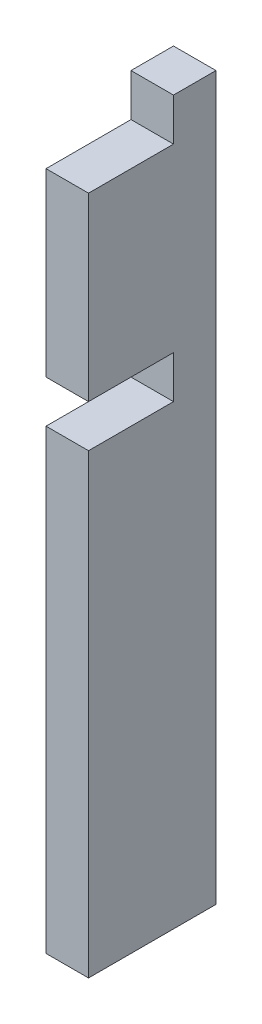
ISO-10303-21;
HEADER;
FILE_DESCRIPTION(('STEP AP214'),'2;1');
FILE_NAME('part.step','',(''),(''),'','','');
FILE_SCHEMA(('AUTOMOTIVE_DESIGN { 1 0 10303 214 1 1 1 1 }'));
ENDSEC;
DATA;
#1=APPLICATION_CONTEXT('core data for automotive mechanical design processes');
#2=APPLICATION_PROTOCOL_DEFINITION('international standard','automotive_design',2000,#1);
#3=PRODUCT_CONTEXT('',#1,'mechanical');
#4=PRODUCT('Part','Part','',(#3));
#5=PRODUCT_RELATED_PRODUCT_CATEGORY('part','',(#4));
#6=PRODUCT_DEFINITION_FORMATION('','',#4);
#7=PRODUCT_DEFINITION_CONTEXT('part definition',#1,'design');
#8=PRODUCT_DEFINITION('design','',#6,#7);
#9=PRODUCT_DEFINITION_SHAPE('','',#8);
#10=(LENGTH_UNIT() NAMED_UNIT(*) SI_UNIT(.MILLI.,.METRE.));
#11=(NAMED_UNIT(*) PLANE_ANGLE_UNIT() SI_UNIT($,.RADIAN.));
#12=(NAMED_UNIT(*) SI_UNIT($,.STERADIAN.) SOLID_ANGLE_UNIT());
#13=UNCERTAINTY_MEASURE_WITH_UNIT(LENGTH_MEASURE(1.E-05),#10,'distance_accuracy_value','');
#14=(GEOMETRIC_REPRESENTATION_CONTEXT(3) GLOBAL_UNCERTAINTY_ASSIGNED_CONTEXT((#13)) GLOBAL_UNIT_ASSIGNED_CONTEXT((#10,
#11,#12)) REPRESENTATION_CONTEXT('',''));
#15=CARTESIAN_POINT('',(0.,0.,0.));
#16=DIRECTION('',(0.,0.,1.));
#17=DIRECTION('',(1.,0.,0.));
#18=AXIS2_PLACEMENT_3D('',#15,#16,#17);
#19=CARTESIAN_POINT('',(3.175,53.975,9.52500000000001));
#20=DIRECTION('',(0.,0.,-1.));
#21=DIRECTION('',(0.,1.,0.));
#22=AXIS2_PLACEMENT_3D('',#19,#20,#21);
#23=PLANE('',#22);
#24=DIRECTION('',(0.,-1.,0.));
#25=VECTOR('',#24,1.);
#26=CARTESIAN_POINT('',(-3.175,53.975,9.52500000000001));
#27=LINE('',#26,#25);
#28=CARTESIAN_POINT('',(-3.175,47.625,9.52500000000001));
#29=VERTEX_POINT('',#28);
#30=CARTESIAN_POINT('',(-3.175,20.6375,9.52500000000001));
#31=VERTEX_POINT('',#30);
#32=EDGE_CURVE('E131',#29,#31,#27,.T.);
#33=ORIENTED_EDGE('',*,*,#32,.T.);
#34=DIRECTION('',(1.,0.,0.));
#35=VECTOR('',#34,1.);
#36=CARTESIAN_POINT('',(-3.175,20.6375,9.52500000000001));
#37=LINE('',#36,#35);
#38=CARTESIAN_POINT('',(3.175,20.6375,9.52500000000001));
#39=VERTEX_POINT('',#38);
#40=EDGE_CURVE('E187',#31,#39,#37,.T.);
#41=ORIENTED_EDGE('',*,*,#40,.T.);
#42=DIRECTION('',(0.,-1.,0.));
#43=VECTOR('',#42,1.);
#44=CARTESIAN_POINT('',(3.175,53.975,9.52500000000001));
#45=LINE('',#44,#43);
#46=CARTESIAN_POINT('',(3.175,47.625,9.52500000000001));
#47=VERTEX_POINT('',#46);
#48=EDGE_CURVE('E152',#47,#39,#45,.T.);
#49=ORIENTED_EDGE('',*,*,#48,.F.);
#50=DIRECTION('',(1.,0.,0.));
#51=VECTOR('',#50,1.);
#52=CARTESIAN_POINT('',(-3.175,47.625,9.52500000000001));
#53=LINE('',#52,#51);
#54=EDGE_CURVE('E166',#29,#47,#53,.T.);
#55=ORIENTED_EDGE('',*,*,#54,.F.);
#56=EDGE_LOOP('',(#33,#41,#49,#55));
#57=FACE_BOUND('',#56,.T.);
#58=ADVANCED_FACE('F31',(#57),#23,.F.);
#59=CARTESIAN_POINT('',(3.175,53.975,-9.52499999999999));
#60=DIRECTION('',(0.,0.,1.));
#61=DIRECTION('',(0.,-1.,0.));
#62=AXIS2_PLACEMENT_3D('',#59,#60,#61);
#63=PLANE('',#62);
#64=DIRECTION('',(0.,1.,0.));
#65=VECTOR('',#64,1.);
#66=CARTESIAN_POINT('',(-3.175,53.975,-9.52499999999999));
#67=LINE('',#66,#65);
#68=CARTESIAN_POINT('',(-3.175,-53.975,-9.52500000000001));
#69=VERTEX_POINT('',#68);
#70=CARTESIAN_POINT('',(-3.175,53.975,-9.52499999999999));
#71=VERTEX_POINT('',#70);
#72=EDGE_CURVE('E136',#69,#71,#67,.T.);
#73=ORIENTED_EDGE('',*,*,#72,.T.);
#74=DIRECTION('',(-1.,0.,0.));
#75=VECTOR('',#74,1.);
#76=CARTESIAN_POINT('',(3.175,53.975,-9.52499999999999));
#77=LINE('',#76,#75);
#78=CARTESIAN_POINT('',(3.175,53.975,-9.52499999999999));
#79=VERTEX_POINT('',#78);
#80=EDGE_CURVE('E11',#79,#71,#77,.T.);
#81=ORIENTED_EDGE('',*,*,#80,.F.);
#82=DIRECTION('',(0.,1.,0.));
#83=VECTOR('',#82,1.);
#84=CARTESIAN_POINT('',(3.175,53.975,-9.52499999999999));
#85=LINE('',#84,#83);
#86=CARTESIAN_POINT('',(3.175,-53.975,-9.52500000000001));
#87=VERTEX_POINT('',#86);
#88=EDGE_CURVE('E141',#87,#79,#85,.T.);
#89=ORIENTED_EDGE('',*,*,#88,.F.);
#90=DIRECTION('',(-1.,0.,0.));
#91=VECTOR('',#90,1.);
#92=CARTESIAN_POINT('',(3.175,-53.975,-9.52500000000001));
#93=LINE('',#92,#91);
#94=EDGE_CURVE('E142',#87,#69,#93,.T.);
#95=ORIENTED_EDGE('',*,*,#94,.T.);
#96=EDGE_LOOP('',(#73,#81,#89,#95));
#97=FACE_BOUND('',#96,.T.);
#98=ADVANCED_FACE('F33',(#97),#63,.F.);
#99=CARTESIAN_POINT('',(3.175,53.975,9.52500000000001));
#100=DIRECTION('',(0.,-1.,0.));
#101=DIRECTION('',(0.,0.,-1.));
#102=AXIS2_PLACEMENT_3D('',#99,#100,#101);
#103=PLANE('',#102);
#104=DIRECTION('',(0.,0.,1.));
#105=VECTOR('',#104,1.);
#106=CARTESIAN_POINT('',(-3.175,53.975,9.52500000000001));
#107=LINE('',#106,#105);
#108=CARTESIAN_POINT('',(-3.175,53.975,-3.17499999999999));
#109=VERTEX_POINT('',#108);
#110=EDGE_CURVE('E132',#71,#109,#107,.T.);
#111=ORIENTED_EDGE('',*,*,#110,.T.);
#112=DIRECTION('',(1.,0.,0.));
#113=VECTOR('',#112,1.);
#114=CARTESIAN_POINT('',(-3.175,53.975,-3.17499999999999));
#115=LINE('',#114,#113);
#116=CARTESIAN_POINT('',(3.175,53.975,-3.17499999999999));
#117=VERTEX_POINT('',#116);
#118=EDGE_CURVE('E158',#109,#117,#115,.T.);
#119=ORIENTED_EDGE('',*,*,#118,.T.);
#120=DIRECTION('',(0.,0.,1.));
#121=VECTOR('',#120,1.);
#122=CARTESIAN_POINT('',(3.175,53.975,9.52500000000001));
#123=LINE('',#122,#121);
#124=EDGE_CURVE('E173',#79,#117,#123,.T.);
#125=ORIENTED_EDGE('',*,*,#124,.F.);
#126=ORIENTED_EDGE('',*,*,#80,.T.);
#127=EDGE_LOOP('',(#111,#119,#125,#126));
#128=FACE_BOUND('',#127,.T.);
#129=ADVANCED_FACE('F225',(#128),#103,.F.);
#130=CARTESIAN_POINT('',(3.175,14.2875,9.525));
#131=VERTEX_POINT('',#130);
#132=CARTESIAN_POINT('',(3.175,-53.975,9.52499999999999));
#133=VERTEX_POINT('',#132);
#134=EDGE_CURVE('E124',#131,#133,#45,.T.);
#135=ORIENTED_EDGE('',*,*,#134,.F.);
#136=DIRECTION('',(1.,0.,0.));
#137=VECTOR('',#136,1.);
#138=CARTESIAN_POINT('',(-3.175,14.2875,9.525));
#139=LINE('',#138,#137);
#140=CARTESIAN_POINT('',(-3.175,14.2875,9.525));
#141=VERTEX_POINT('',#140);
#142=EDGE_CURVE('E111',#141,#131,#139,.T.);
#143=ORIENTED_EDGE('',*,*,#142,.F.);
#144=CARTESIAN_POINT('',(-3.175,-53.975,9.52499999999999));
#145=VERTEX_POINT('',#144);
#146=EDGE_CURVE('E122',#141,#145,#27,.T.);
#147=ORIENTED_EDGE('',*,*,#146,.T.);
#148=DIRECTION('',(-1.,0.,0.));
#149=VECTOR('',#148,1.);
#150=CARTESIAN_POINT('',(3.175,-53.975,9.52499999999999));
#151=LINE('',#150,#149);
#152=EDGE_CURVE('E39',#133,#145,#151,.T.);
#153=ORIENTED_EDGE('',*,*,#152,.F.);
#154=EDGE_LOOP('',(#135,#143,#147,#153));
#155=FACE_BOUND('',#154,.T.);
#156=ADVANCED_FACE('F120',(#155),#23,.F.);
#157=CARTESIAN_POINT('',(3.175,-53.975,9.52499999999999));
#158=DIRECTION('',(0.,1.,0.));
#159=DIRECTION('',(0.,0.,1.));
#160=AXIS2_PLACEMENT_3D('',#157,#158,#159);
#161=PLANE('',#160);
#162=DIRECTION('',(0.,0.,-1.));
#163=VECTOR('',#162,1.);
#164=CARTESIAN_POINT('',(-3.175,-53.975,9.52499999999999));
#165=LINE('',#164,#163);
#166=EDGE_CURVE('E130',#145,#69,#165,.T.);
#167=ORIENTED_EDGE('',*,*,#166,.T.);
#168=ORIENTED_EDGE('',*,*,#94,.F.);
#169=DIRECTION('',(0.,0.,-1.));
#170=VECTOR('',#169,1.);
#171=CARTESIAN_POINT('',(3.175,-53.975,9.52499999999999));
#172=LINE('',#171,#170);
#173=EDGE_CURVE('E144',#133,#87,#172,.T.);
#174=ORIENTED_EDGE('',*,*,#173,.F.);
#175=ORIENTED_EDGE('',*,*,#152,.T.);
#176=EDGE_LOOP('',(#167,#168,#174,#175));
#177=FACE_BOUND('',#176,.T.);
#178=ADVANCED_FACE('F147',(#177),#161,.F.);
#179=CARTESIAN_POINT('',(3.175,-53.975,-9.525));
#180=DIRECTION('',(1.,0.,0.));
#181=DIRECTION('',(0.,0.,-1.));
#182=AXIS2_PLACEMENT_3D('',#179,#180,#181);
#183=PLANE('',#182);
#184=DIRECTION('',(0.,0.,1.));
#185=VECTOR('',#184,1.);
#186=CARTESIAN_POINT('',(3.175,20.6375,9.52500000000001));
#187=LINE('',#186,#185);
#188=CARTESIAN_POINT('',(3.175,20.6375,-3.175));
#189=VERTEX_POINT('',#188);
#190=EDGE_CURVE('E116',#189,#39,#187,.T.);
#191=ORIENTED_EDGE('',*,*,#190,.F.);
#192=DIRECTION('',(0.,1.,0.));
#193=VECTOR('',#192,1.);
#194=CARTESIAN_POINT('',(3.175,20.6375,-3.175));
#195=LINE('',#194,#193);
#196=CARTESIAN_POINT('',(3.175,14.2875,-3.175));
#197=VERTEX_POINT('',#196);
#198=EDGE_CURVE('E180',#197,#189,#195,.T.);
#199=ORIENTED_EDGE('',*,*,#198,.F.);
#200=DIRECTION('',(0.,0.,-1.));
#201=VECTOR('',#200,1.);
#202=CARTESIAN_POINT('',(3.175,14.2875,9.525));
#203=LINE('',#202,#201);
#204=EDGE_CURVE('E178',#131,#197,#203,.T.);
#205=ORIENTED_EDGE('',*,*,#204,.F.);
#206=ORIENTED_EDGE('',*,*,#134,.T.);
#207=ORIENTED_EDGE('',*,*,#173,.T.);
#208=ORIENTED_EDGE('',*,*,#88,.T.);
#209=ORIENTED_EDGE('',*,*,#124,.T.);
#210=DIRECTION('',(0.,1.,0.));
#211=VECTOR('',#210,1.);
#212=CARTESIAN_POINT('',(3.175,53.975,-3.17499999999999));
#213=LINE('',#212,#211);
#214=CARTESIAN_POINT('',(3.175,47.625,-3.17499999999999));
#215=VERTEX_POINT('',#214);
#216=EDGE_CURVE('E169',#215,#117,#213,.T.);
#217=ORIENTED_EDGE('',*,*,#216,.F.);
#218=DIRECTION('',(0.,0.,-1.));
#219=VECTOR('',#218,1.);
#220=CARTESIAN_POINT('',(3.175,47.625,9.52500000000001));
#221=LINE('',#220,#219);
#222=EDGE_CURVE('E190',#47,#215,#221,.T.);
#223=ORIENTED_EDGE('',*,*,#222,.F.);
#224=ORIENTED_EDGE('',*,*,#48,.T.);
#225=EDGE_LOOP('',(#191,#199,#205,#206,#207,#208,#209,#217,#223,#224));
#226=FACE_BOUND('',#225,.T.);
#227=ADVANCED_FACE('F176',(#226),#183,.T.);
#228=CARTESIAN_POINT('',(-3.175,-53.975,-9.525));
#229=DIRECTION('',(1.,0.,0.));
#230=DIRECTION('',(0.,0.,-1.));
#231=AXIS2_PLACEMENT_3D('',#228,#229,#230);
#232=PLANE('',#231);
#233=DIRECTION('',(0.,1.,0.));
#234=VECTOR('',#233,1.);
#235=CARTESIAN_POINT('',(-3.175,20.6375,-3.175));
#236=LINE('',#235,#234);
#237=CARTESIAN_POINT('',(-3.175,14.2875,-3.175));
#238=VERTEX_POINT('',#237);
#239=CARTESIAN_POINT('',(-3.175,20.6375,-3.175));
#240=VERTEX_POINT('',#239);
#241=EDGE_CURVE('E46',#238,#240,#236,.T.);
#242=ORIENTED_EDGE('',*,*,#241,.T.);
#243=DIRECTION('',(0.,0.,1.));
#244=VECTOR('',#243,1.);
#245=CARTESIAN_POINT('',(-3.175,20.6375,9.52500000000001));
#246=LINE('',#245,#244);
#247=EDGE_CURVE('E125',#240,#31,#246,.T.);
#248=ORIENTED_EDGE('',*,*,#247,.T.);
#249=ORIENTED_EDGE('',*,*,#32,.F.);
#250=DIRECTION('',(0.,0.,-1.));
#251=VECTOR('',#250,1.);
#252=CARTESIAN_POINT('',(-3.175,47.625,9.52500000000001));
#253=LINE('',#252,#251);
#254=CARTESIAN_POINT('',(-3.175,47.625,-3.17499999999999));
#255=VERTEX_POINT('',#254);
#256=EDGE_CURVE('E194',#29,#255,#253,.T.);
#257=ORIENTED_EDGE('',*,*,#256,.T.);
#258=DIRECTION('',(0.,1.,0.));
#259=VECTOR('',#258,1.);
#260=CARTESIAN_POINT('',(-3.175,53.975,-3.17499999999999));
#261=LINE('',#260,#259);
#262=EDGE_CURVE('E54',#255,#109,#261,.T.);
#263=ORIENTED_EDGE('',*,*,#262,.T.);
#264=ORIENTED_EDGE('',*,*,#110,.F.);
#265=ORIENTED_EDGE('',*,*,#72,.F.);
#266=ORIENTED_EDGE('',*,*,#166,.F.);
#267=ORIENTED_EDGE('',*,*,#146,.F.);
#268=DIRECTION('',(0.,0.,-1.));
#269=VECTOR('',#268,1.);
#270=CARTESIAN_POINT('',(-3.175,14.2875,9.525));
#271=LINE('',#270,#269);
#272=EDGE_CURVE('E107',#141,#238,#271,.T.);
#273=ORIENTED_EDGE('',*,*,#272,.T.);
#274=EDGE_LOOP('',(#242,#248,#249,#257,#263,#264,#265,#266,#267,#273));
#275=FACE_BOUND('',#274,.T.);
#276=ADVANCED_FACE('F128',(#275),#232,.F.);
#277=CARTESIAN_POINT('',(-3.175,53.975,-3.17499999999999));
#278=DIRECTION('',(0.,0.,-1.));
#279=DIRECTION('',(0.,1.,0.));
#280=AXIS2_PLACEMENT_3D('',#277,#278,#279);
#281=PLANE('',#280);
#282=ORIENTED_EDGE('',*,*,#216,.T.);
#283=ORIENTED_EDGE('',*,*,#118,.F.);
#284=ORIENTED_EDGE('',*,*,#262,.F.);
#285=DIRECTION('',(1.,0.,0.));
#286=VECTOR('',#285,1.);
#287=CARTESIAN_POINT('',(-3.175,47.625,-3.17499999999999));
#288=LINE('',#287,#286);
#289=EDGE_CURVE('E162',#255,#215,#288,.T.);
#290=ORIENTED_EDGE('',*,*,#289,.T.);
#291=EDGE_LOOP('',(#282,#283,#284,#290));
#292=FACE_BOUND('',#291,.T.);
#293=ADVANCED_FACE('F200',(#292),#281,.F.);
#294=CARTESIAN_POINT('',(-3.175,47.625,9.52500000000001));
#295=DIRECTION('',(0.,-1.,0.));
#296=DIRECTION('',(0.,0.,-1.));
#297=AXIS2_PLACEMENT_3D('',#294,#295,#296);
#298=PLANE('',#297);
#299=ORIENTED_EDGE('',*,*,#222,.T.);
#300=ORIENTED_EDGE('',*,*,#289,.F.);
#301=ORIENTED_EDGE('',*,*,#256,.F.);
#302=ORIENTED_EDGE('',*,*,#54,.T.);
#303=EDGE_LOOP('',(#299,#300,#301,#302));
#304=FACE_BOUND('',#303,.T.);
#305=ADVANCED_FACE('F209',(#304),#298,.F.);
#306=CARTESIAN_POINT('',(-3.175,20.6375,9.52500000000001));
#307=DIRECTION('',(0.,1.,0.));
#308=DIRECTION('',(0.,0.,1.));
#309=AXIS2_PLACEMENT_3D('',#306,#307,#308);
#310=PLANE('',#309);
#311=ORIENTED_EDGE('',*,*,#190,.T.);
#312=ORIENTED_EDGE('',*,*,#40,.F.);
#313=ORIENTED_EDGE('',*,*,#247,.F.);
#314=DIRECTION('',(1.,0.,0.));
#315=VECTOR('',#314,1.);
#316=CARTESIAN_POINT('',(-3.175,20.6375,-3.175));
#317=LINE('',#316,#315);
#318=EDGE_CURVE('E191',#240,#189,#317,.T.);
#319=ORIENTED_EDGE('',*,*,#318,.T.);
#320=EDGE_LOOP('',(#311,#312,#313,#319));
#321=FACE_BOUND('',#320,.T.);
#322=ADVANCED_FACE('F208',(#321),#310,.F.);
#323=CARTESIAN_POINT('',(-3.175,20.6375,-3.175));
#324=DIRECTION('',(0.,0.,-1.));
#325=DIRECTION('',(0.,1.,0.));
#326=AXIS2_PLACEMENT_3D('',#323,#324,#325);
#327=PLANE('',#326);
#328=ORIENTED_EDGE('',*,*,#198,.T.);
#329=ORIENTED_EDGE('',*,*,#318,.F.);
#330=ORIENTED_EDGE('',*,*,#241,.F.);
#331=DIRECTION('',(1.,0.,0.));
#332=VECTOR('',#331,1.);
#333=CARTESIAN_POINT('',(-3.175,14.2875,-3.175));
#334=LINE('',#333,#332);
#335=EDGE_CURVE('E113',#238,#197,#334,.T.);
#336=ORIENTED_EDGE('',*,*,#335,.T.);
#337=EDGE_LOOP('',(#328,#329,#330,#336));
#338=FACE_BOUND('',#337,.T.);
#339=ADVANCED_FACE('F216',(#338),#327,.F.);
#340=CARTESIAN_POINT('',(-3.175,14.2875,9.525));
#341=DIRECTION('',(0.,-1.,0.));
#342=DIRECTION('',(0.,0.,-1.));
#343=AXIS2_PLACEMENT_3D('',#340,#341,#342);
#344=PLANE('',#343);
#345=ORIENTED_EDGE('',*,*,#204,.T.);
#346=ORIENTED_EDGE('',*,*,#335,.F.);
#347=ORIENTED_EDGE('',*,*,#272,.F.);
#348=ORIENTED_EDGE('',*,*,#142,.T.);
#349=EDGE_LOOP('',(#345,#346,#347,#348));
#350=FACE_BOUND('',#349,.T.);
#351=ADVANCED_FACE('F110',(#350),#344,.F.);
#352=CLOSED_SHELL('',(#58,#98,#129,#156,#178,#227,#276,#293,#305,#322,#339,#351));
#353=MANIFOLD_SOLID_BREP('B2',#352);
#354=ADVANCED_BREP_SHAPE_REPRESENTATION('',(#18,#353),#14);
#355=SHAPE_DEFINITION_REPRESENTATION(#9,#354);
ENDSEC;
END-ISO-10303-21;
